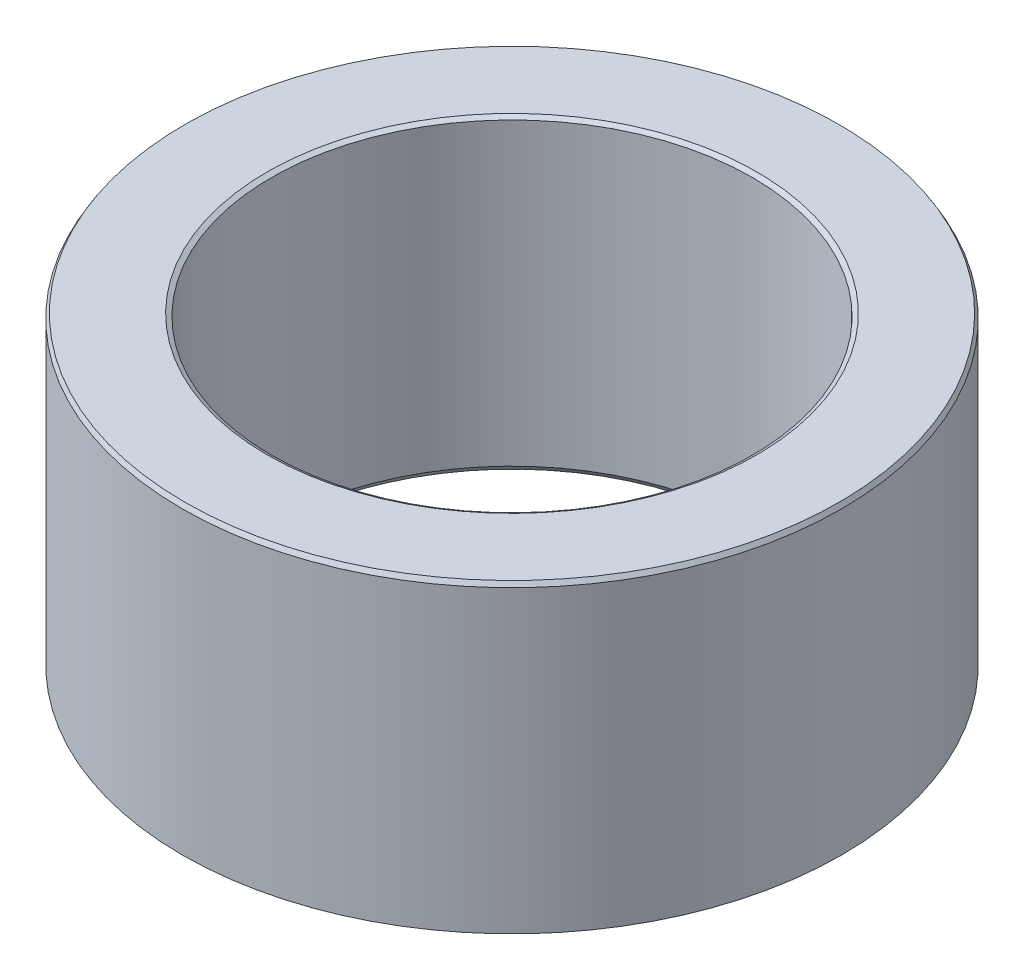
ISO-10303-21;
HEADER;
FILE_DESCRIPTION(('STEP AP214'),'2;1');
FILE_NAME('part.step','',(''),(''),'','','');
FILE_SCHEMA(('AUTOMOTIVE_DESIGN { 1 0 10303 214 1 1 1 1 }'));
ENDSEC;
DATA;
#1=APPLICATION_CONTEXT('core data for automotive mechanical design processes');
#2=APPLICATION_PROTOCOL_DEFINITION('international standard','automotive_design',2000,#1);
#3=PRODUCT_CONTEXT('',#1,'mechanical');
#4=PRODUCT('Part','Part','',(#3));
#5=PRODUCT_RELATED_PRODUCT_CATEGORY('part','',(#4));
#6=PRODUCT_DEFINITION_FORMATION('','',#4);
#7=PRODUCT_DEFINITION_CONTEXT('part definition',#1,'design');
#8=PRODUCT_DEFINITION('design','',#6,#7);
#9=PRODUCT_DEFINITION_SHAPE('','',#8);
#10=(LENGTH_UNIT() NAMED_UNIT(*) SI_UNIT(.MILLI.,.METRE.));
#11=(NAMED_UNIT(*) PLANE_ANGLE_UNIT() SI_UNIT($,.RADIAN.));
#12=(NAMED_UNIT(*) SI_UNIT($,.STERADIAN.) SOLID_ANGLE_UNIT());
#13=UNCERTAINTY_MEASURE_WITH_UNIT(LENGTH_MEASURE(1.E-05),#10,'distance_accuracy_value','');
#14=(GEOMETRIC_REPRESENTATION_CONTEXT(3) GLOBAL_UNCERTAINTY_ASSIGNED_CONTEXT((#13)) GLOBAL_UNIT_ASSIGNED_CONTEXT((#10,
#11,#12)) REPRESENTATION_CONTEXT('',''));
#15=CARTESIAN_POINT('',(0.,0.,0.));
#16=DIRECTION('',(0.,0.,1.));
#17=DIRECTION('',(1.,0.,0.));
#18=AXIS2_PLACEMENT_3D('',#15,#16,#17);
#19=CARTESIAN_POINT('',(0.,39.5457287519406,0.));
#20=DIRECTION('',(0.,-1.,0.));
#21=DIRECTION('',(0.,0.,-1.));
#22=AXIS2_PLACEMENT_3D('',#19,#20,#21);
#23=CYLINDRICAL_SURFACE('',#22,42.5);
#24=CARTESIAN_POINT('',(0.,0.329822876127116,0.));
#25=DIRECTION('',(0.,1.,0.));
#26=DIRECTION('',(0.,0.,1.));
#27=AXIS2_PLACEMENT_3D('',#24,#25,#26);
#28=CIRCLE('',#27,42.5);
#29=CARTESIAN_POINT('',(0.,0.329822876127116,42.5));
#30=VERTEX_POINT('',#29);
#31=EDGE_CURVE('E10',#30,#30,#28,.T.);
#32=ORIENTED_EDGE('',*,*,#31,.T.);
#33=EDGE_LOOP('',(#32));
#34=FACE_BOUND('',#33,.T.);
#35=CARTESIAN_POINT('',(0.,38.9744587729899,0.));
#36=DIRECTION('',(0.,1.,0.));
#37=DIRECTION('',(0.,0.,1.));
#38=AXIS2_PLACEMENT_3D('',#35,#36,#37);
#39=CIRCLE('',#38,42.5);
#40=CARTESIAN_POINT('',(0.,38.9744587729899,42.5));
#41=VERTEX_POINT('',#40);
#42=EDGE_CURVE('E50',#41,#41,#39,.F.);
#43=ORIENTED_EDGE('',*,*,#42,.T.);
#44=EDGE_LOOP('',(#43));
#45=FACE_BOUND('',#44,.T.);
#46=ADVANCED_FACE('F39',(#34,#45),#23,.T.);
#47=CARTESIAN_POINT('',(0.,39.5457287519406,0.));
#48=DIRECTION('',(0.,1.,0.));
#49=DIRECTION('',(0.,0.,1.));
#50=AXIS2_PLACEMENT_3D('',#47,#48,#49);
#51=PLANE('',#50);
#52=CARTESIAN_POINT('',(0.,39.5457287519406,0.));
#53=DIRECTION('',(0.,1.,0.));
#54=DIRECTION('',(0.,0.,1.));
#55=AXIS2_PLACEMENT_3D('',#52,#53,#54);
#56=CIRCLE('',#55,31.574777703707);
#57=CARTESIAN_POINT('',(0.,39.5457287519406,31.574777703707));
#58=VERTEX_POINT('',#57);
#59=EDGE_CURVE('E58',#58,#58,#56,.F.);
#60=ORIENTED_EDGE('',*,*,#59,.T.);
#61=EDGE_LOOP('',(#60));
#62=FACE_BOUND('',#61,.T.);
#63=CARTESIAN_POINT('',(0.,39.5457287519406,0.));
#64=DIRECTION('',(0.,1.,0.));
#65=DIRECTION('',(0.,0.,1.));
#66=AXIS2_PLACEMENT_3D('',#63,#64,#65);
#67=CIRCLE('',#66,42.1701771238729);
#68=CARTESIAN_POINT('',(0.,39.5457287519406,42.1701771238729));
#69=VERTEX_POINT('',#68);
#70=EDGE_CURVE('E61',#69,#69,#67,.T.);
#71=ORIENTED_EDGE('',*,*,#70,.T.);
#72=EDGE_LOOP('',(#71));
#73=FACE_BOUND('',#72,.T.);
#74=ADVANCED_FACE('F88',(#62,#73),#51,.T.);
#75=CARTESIAN_POINT('',(0.,0.,0.));
#76=DIRECTION('',(0.,1.,0.));
#77=DIRECTION('',(0.,0.,1.));
#78=AXIS2_PLACEMENT_3D('',#75,#76,#77);
#79=PLANE('',#78);
#80=CARTESIAN_POINT('',(0.,0.,0.));
#81=DIRECTION('',(0.,1.,0.));
#82=DIRECTION('',(0.,0.,1.));
#83=AXIS2_PLACEMENT_3D('',#80,#81,#82);
#84=CIRCLE('',#83,31.3333306008835);
#85=CARTESIAN_POINT('',(0.,0.,31.3333306008835));
#86=VERTEX_POINT('',#85);
#87=EDGE_CURVE('E51',#86,#86,#84,.T.);
#88=ORIENTED_EDGE('',*,*,#87,.T.);
#89=EDGE_LOOP('',(#88));
#90=FACE_BOUND('',#89,.T.);
#91=CARTESIAN_POINT('',(0.,0.,0.));
#92=DIRECTION('',(0.,1.,0.));
#93=DIRECTION('',(0.,0.,1.));
#94=AXIS2_PLACEMENT_3D('',#91,#92,#93);
#95=CIRCLE('',#94,41.9287300210493);
#96=CARTESIAN_POINT('',(0.,0.,41.9287300210493));
#97=VERTEX_POINT('',#96);
#98=EDGE_CURVE('E54',#97,#97,#95,.F.);
#99=ORIENTED_EDGE('',*,*,#98,.T.);
#100=EDGE_LOOP('',(#99));
#101=FACE_BOUND('',#100,.T.);
#102=ADVANCED_FACE('F83',(#90,#101),#79,.F.);
#103=CARTESIAN_POINT('',(0.,39.5457287519406,0.));
#104=DIRECTION('',(0.,-1.,0.));
#105=DIRECTION('',(0.,0.,-1.));
#106=AXIS2_PLACEMENT_3D('',#103,#104,#105);
#107=CYLINDRICAL_SURFACE('',#106,31.0035077247564);
#108=CARTESIAN_POINT('',(0.,39.2159058758135,0.));
#109=DIRECTION('',(0.,1.,0.));
#110=DIRECTION('',(0.,0.,1.));
#111=AXIS2_PLACEMENT_3D('',#108,#109,#110);
#112=CIRCLE('',#111,31.0035077247564);
#113=CARTESIAN_POINT('',(0.,39.2159058758135,31.0035077247564));
#114=VERTEX_POINT('',#113);
#115=EDGE_CURVE('E67',#114,#114,#112,.T.);
#116=ORIENTED_EDGE('',*,*,#115,.T.);
#117=EDGE_LOOP('',(#116));
#118=FACE_BOUND('',#117,.T.);
#119=CARTESIAN_POINT('',(0.,0.571269978950698,0.));
#120=DIRECTION('',(0.,1.,0.));
#121=DIRECTION('',(0.,0.,1.));
#122=AXIS2_PLACEMENT_3D('',#119,#120,#121);
#123=CIRCLE('',#122,31.0035077247564);
#124=CARTESIAN_POINT('',(0.,0.571269978950698,31.0035077247564));
#125=VERTEX_POINT('',#124);
#126=EDGE_CURVE('E69',#125,#125,#123,.F.);
#127=ORIENTED_EDGE('',*,*,#126,.T.);
#128=EDGE_LOOP('',(#127));
#129=FACE_BOUND('',#128,.T.);
#130=ADVANCED_FACE('F71',(#118,#129),#107,.F.);
#131=CARTESIAN_POINT('',(0.,39.2159058758135,0.));
#132=DIRECTION('',(0.,1.,0.));
#133=DIRECTION('',(0.,0.,1.));
#134=AXIS2_PLACEMENT_3D('',#131,#132,#133);
#135=CONICAL_SURFACE('',#134,31.0035077247564,1.04719755119659);
#136=ORIENTED_EDGE('',*,*,#59,.F.);
#137=EDGE_LOOP('',(#136));
#138=FACE_BOUND('',#137,.T.);
#139=ORIENTED_EDGE('',*,*,#115,.F.);
#140=EDGE_LOOP('',(#139));
#141=FACE_BOUND('',#140,.T.);
#142=ADVANCED_FACE('F77',(#138,#141),#135,.F.);
#143=CARTESIAN_POINT('',(0.,0.,0.));
#144=DIRECTION('',(0.,-1.,0.));
#145=DIRECTION('',(0.,0.,-1.));
#146=AXIS2_PLACEMENT_3D('',#143,#144,#145);
#147=CONICAL_SURFACE('',#146,31.3333306008835,0.523598775598294);
#148=ORIENTED_EDGE('',*,*,#126,.F.);
#149=EDGE_LOOP('',(#148));
#150=FACE_BOUND('',#149,.T.);
#151=ORIENTED_EDGE('',*,*,#87,.F.);
#152=EDGE_LOOP('',(#151));
#153=FACE_BOUND('',#152,.T.);
#154=ADVANCED_FACE('F73',(#150,#153),#147,.F.);
#155=CARTESIAN_POINT('',(0.,0.329822876127116,0.));
#156=DIRECTION('',(0.,1.,0.));
#157=DIRECTION('',(0.,0.,1.));
#158=AXIS2_PLACEMENT_3D('',#155,#156,#157);
#159=CONICAL_SURFACE('',#158,42.5,1.0471975511966);
#160=CARTESIAN_POINT('',(0.,0.,41.9287300210493));
#161=CARTESIAN_POINT('',(0.,0.00343565495965672,41.9346807499967));
#162=CARTESIAN_POINT('',(0.,0.00687130991931452,41.9406314789441));
#163=CARTESIAN_POINT('',(0.,0.0137426198386301,41.9525329368389));
#164=CARTESIAN_POINT('',(0.,0.0171782747982879,41.9584836657864));
#165=CARTESIAN_POINT('',(0.,0.0240495847176025,41.9703851236812));
#166=CARTESIAN_POINT('',(0.,0.0274852396772592,41.9763358526286));
#167=CARTESIAN_POINT('',(0.,0.0343565495965739,41.9882373105234));
#168=CARTESIAN_POINT('',(0.,0.0377922045562318,41.9941880394708));
#169=CARTESIAN_POINT('',(0.,0.044663514475547,42.0060894973656));
#170=CARTESIAN_POINT('',(0.,0.0480991694352044,42.012040226313));
#171=CARTESIAN_POINT('',(0.,0.0549704793545192,42.0239416842078));
#172=CARTESIAN_POINT('',(0.,0.0584061343141767,42.0298924131552));
#173=CARTESIAN_POINT('',(0.,0.0652774442334916,42.04179387105));
#174=CARTESIAN_POINT('',(0.,0.0687130991931489,42.0477445999974));
#175=CARTESIAN_POINT('',(0.,0.0755844091124641,42.0596460578922));
#176=CARTESIAN_POINT('',(0.,0.0790200640721221,42.0655967868396));
#177=CARTESIAN_POINT('',(0.,0.0858913739914367,42.0774982447344));
#178=CARTESIAN_POINT('',(0.,0.0893270289510934,42.0834489736818));
#179=CARTESIAN_POINT('',(0.,0.096198338870408,42.0953504315766));
#180=CARTESIAN_POINT('',(0.,0.099633993830066,42.101301160524));
#181=CARTESIAN_POINT('',(0.,0.106505303749381,42.1132026184188));
#182=CARTESIAN_POINT('',(0.,0.109940958709039,42.1191533473662));
#183=CARTESIAN_POINT('',(0.,0.116812268628353,42.131054805261));
#184=CARTESIAN_POINT('',(0.,0.120247923588011,42.1370055342084));
#185=CARTESIAN_POINT('',(0.,0.127119233507326,42.1489069921032));
#186=CARTESIAN_POINT('',(0.,0.130554888466984,42.1548577210506));
#187=CARTESIAN_POINT('',(0.,0.137426198386299,42.1667591789455));
#188=CARTESIAN_POINT('',(0.,0.140861853345955,42.1727099078929));
#189=CARTESIAN_POINT('',(0.,0.14773316326527,42.1846113657877));
#190=CARTESIAN_POINT('',(0.,0.151168818224928,42.1905620947351));
#191=CARTESIAN_POINT('',(0.,0.158040128144243,42.2024635526299));
#192=CARTESIAN_POINT('',(0.,0.1614757831039,42.2084142815773));
#193=CARTESIAN_POINT('',(0.,0.168347093023215,42.2203157394721));
#194=CARTESIAN_POINT('',(0.,0.171782747982873,42.2262664684195));
#195=CARTESIAN_POINT('',(0.,0.178654057902188,42.2381679263143));
#196=CARTESIAN_POINT('',(0.,0.182089712861846,42.2441186552617));
#197=CARTESIAN_POINT('',(0.,0.18896102278116,42.2560201131565));
#198=CARTESIAN_POINT('',(0.,0.192396677740817,42.2619708421039));
#199=CARTESIAN_POINT('',(0.,0.199267987660132,42.2738722999987));
#200=CARTESIAN_POINT('',(0.,0.20270364261979,42.2798230289461));
#201=CARTESIAN_POINT('',(0.,0.209574952539105,42.2917244868409));
#202=CARTESIAN_POINT('',(0.,0.213010607498762,42.2976752157883));
#203=CARTESIAN_POINT('',(0.,0.219881917418077,42.3095766736831));
#204=CARTESIAN_POINT('',(0.,0.223317572377735,42.3155274026305));
#205=CARTESIAN_POINT('',(0.,0.230188882297049,42.3274288605253));
#206=CARTESIAN_POINT('',(0.,0.233624537256707,42.3333795894727));
#207=CARTESIAN_POINT('',(0.,0.240495847176022,42.3452810473675));
#208=CARTESIAN_POINT('',(0.,0.24393150213568,42.3512317763149));
#209=CARTESIAN_POINT('',(0.,0.250802812054995,42.3631332342097));
#210=CARTESIAN_POINT('',(0.,0.254238467014651,42.3690839631571));
#211=CARTESIAN_POINT('',(0.,0.261109776933966,42.380985421052));
#212=CARTESIAN_POINT('',(0.,0.264545431893624,42.3869361499994));
#213=CARTESIAN_POINT('',(0.,0.271416741812939,42.3988376078942));
#214=CARTESIAN_POINT('',(0.,0.274852396772596,42.4047883368416));
#215=CARTESIAN_POINT('',(0.,0.281723706691911,42.4166897947364));
#216=CARTESIAN_POINT('',(0.,0.285159361651569,42.4226405236838));
#217=CARTESIAN_POINT('',(0.,0.292030671570884,42.4345419815786));
#218=CARTESIAN_POINT('',(0.,0.295466326530542,42.440492710526));
#219=CARTESIAN_POINT('',(0.,0.302337636449856,42.4523941684208));
#220=CARTESIAN_POINT('',(0.,0.305773291409513,42.4583448973682));
#221=CARTESIAN_POINT('',(0.,0.312644601328828,42.470246355263));
#222=CARTESIAN_POINT('',(0.,0.316080256288486,42.4761970842104));
#223=CARTESIAN_POINT('',(0.,0.322951566207801,42.4880985421052));
#224=CARTESIAN_POINT('',(0.,0.326387221167459,42.4940492710526));
#225=CARTESIAN_POINT('',(0.,0.329822876127116,42.5));
#226=B_SPLINE_CURVE_WITH_KNOTS('',3,(#160,#161,#162,#163,#164,#165,#166,#167,#168,#169,#170,
#171,#172,#173,#174,#175,#176,#177,#178,#179,#180,#181,#182,#183,#184,#185,#186,#187,#188,#189,
#190,#191,#192,#193,#194,#195,#196,#197,#198,#199,#200,#201,#202,#203,#204,#205,#206,#207,#208,
#209,#210,#211,#212,#213,#214,#215,#216,#217,#218,#219,#220,#221,#222,#223,#224,#225),
.UNSPECIFIED.,.F.,.F.,(4,2,2,2,2,2,2,2,2,2,2,2,2,2,2,2,2,2,2,2,2,2,2,2,2,2,2,2,2,2,2,2,4),(0.,
0.0206139297579439,0.0412278595158877,0.0618417892738376,0.0824557190317814,0.103069648789725,
0.123683578547669,0.144297508305613,0.164911438063557,0.185525367821507,0.206139297579451,
0.226753227337394,0.247367157095338,0.267981086853282,0.288595016611232,0.309208946369176,
0.32982287612712,0.350436805885064,0.371050735643008,0.391664665400957,0.412278595158901,
0.432892524916845,0.453506454674789,0.474120384432733,0.494734314190677,0.515348243948626,
0.53596217370657,0.556576103464514,0.577190033222458,0.597803962980402,0.618417892738352,
0.639031822496296,0.659645752254239),.UNSPECIFIED.);
#227=EDGE_CURVE('BSEAM76',#97,#30,#226,.T.);
#228=ORIENTED_EDGE('',*,*,#98,.F.);
#229=ORIENTED_EDGE('',*,*,#31,.F.);
#230=ORIENTED_EDGE('',*,*,#227,.T.);
#231=ORIENTED_EDGE('',*,*,#227,.F.);
#232=EDGE_LOOP('',(#228,#230,#229,#231));
#233=FACE_BOUND('',#232,.T.);
#234=ADVANCED_FACE('F76',(#233),#159,.T.);
#235=CARTESIAN_POINT('',(0.,39.5457287519406,0.));
#236=DIRECTION('',(0.,-1.,0.));
#237=DIRECTION('',(0.,0.,-1.));
#238=AXIS2_PLACEMENT_3D('',#235,#236,#237);
#239=CONICAL_SURFACE('',#238,42.1701771238729,0.523598775598301);
#240=ORIENTED_EDGE('',*,*,#42,.F.);
#241=EDGE_LOOP('',(#240));
#242=FACE_BOUND('',#241,.T.);
#243=ORIENTED_EDGE('',*,*,#70,.F.);
#244=EDGE_LOOP('',(#243));
#245=FACE_BOUND('',#244,.T.);
#246=ADVANCED_FACE('F45',(#242,#245),#239,.T.);
#247=CLOSED_SHELL('',(#46,#74,#102,#130,#142,#154,#234,#246));
#248=MANIFOLD_SOLID_BREP('B2',#247);
#249=ADVANCED_BREP_SHAPE_REPRESENTATION('',(#18,#248),#14);
#250=SHAPE_DEFINITION_REPRESENTATION(#9,#249);
ENDSEC;
END-ISO-10303-21;
